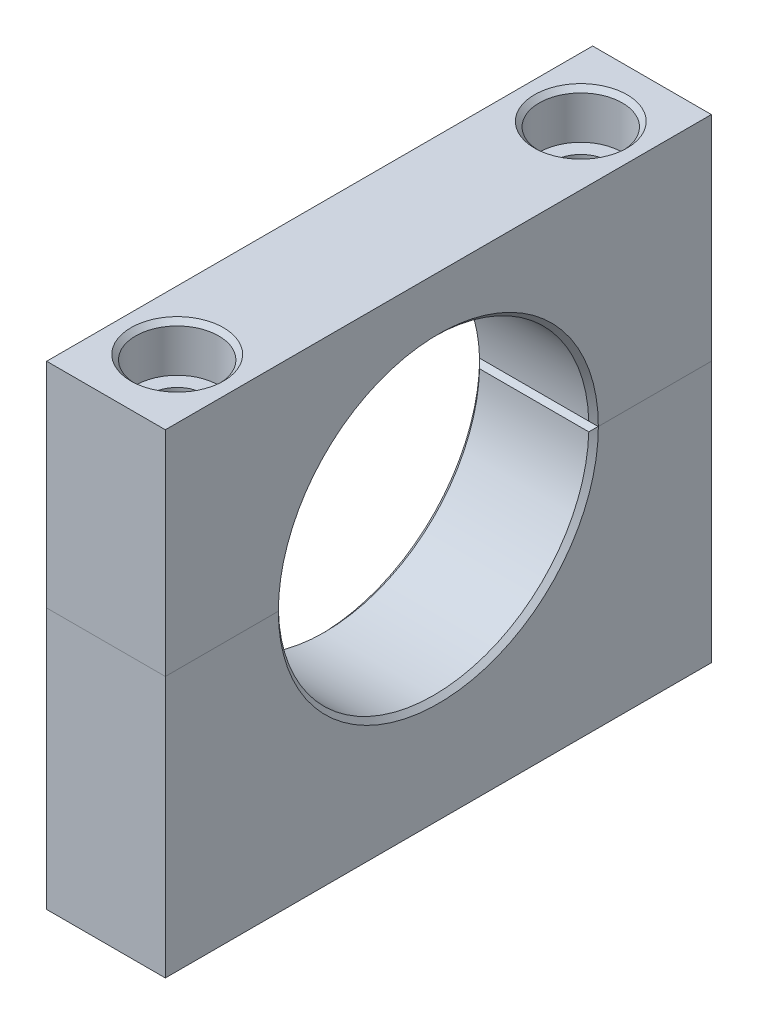
ISO-10303-21;
HEADER;
FILE_DESCRIPTION(('STEP AP214'),'2;1');
FILE_NAME('part.step','',(''),(''),'','','');
FILE_SCHEMA(('AUTOMOTIVE_DESIGN { 1 0 10303 214 1 1 1 1 }'));
ENDSEC;
DATA;
#1=APPLICATION_CONTEXT('core data for automotive mechanical design processes');
#2=APPLICATION_PROTOCOL_DEFINITION('international standard','automotive_design',2000,#1);
#3=PRODUCT_CONTEXT('',#1,'mechanical');
#4=PRODUCT('Part','Part','',(#3));
#5=PRODUCT_RELATED_PRODUCT_CATEGORY('part','',(#4));
#6=PRODUCT_DEFINITION_FORMATION('','',#4);
#7=PRODUCT_DEFINITION_CONTEXT('part definition',#1,'design');
#8=PRODUCT_DEFINITION('design','',#6,#7);
#9=PRODUCT_DEFINITION_SHAPE('','',#8);
#10=(LENGTH_UNIT() NAMED_UNIT(*) SI_UNIT(.MILLI.,.METRE.));
#11=(NAMED_UNIT(*) PLANE_ANGLE_UNIT() SI_UNIT($,.RADIAN.));
#12=(NAMED_UNIT(*) SI_UNIT($,.STERADIAN.) SOLID_ANGLE_UNIT());
#13=UNCERTAINTY_MEASURE_WITH_UNIT(LENGTH_MEASURE(1.E-05),#10,'distance_accuracy_value','');
#14=(GEOMETRIC_REPRESENTATION_CONTEXT(3) GLOBAL_UNCERTAINTY_ASSIGNED_CONTEXT((#13)) GLOBAL_UNIT_ASSIGNED_CONTEXT((#10,
#11,#12)) REPRESENTATION_CONTEXT('',''));
#15=CARTESIAN_POINT('',(0.,0.,0.));
#16=DIRECTION('',(0.,0.,1.));
#17=DIRECTION('',(1.,0.,0.));
#18=AXIS2_PLACEMENT_3D('',#15,#16,#17);
#19=CARTESIAN_POINT('',(15.875,0.,0.));
#20=DIRECTION('',(-1.,0.,0.));
#21=DIRECTION('',(0.,0.,1.));
#22=AXIS2_PLACEMENT_3D('',#19,#20,#21);
#23=CYLINDRICAL_SURFACE('',#22,20.7645);
#24=CARTESIAN_POINT('',(15.24,0.,0.));
#25=DIRECTION('',(1.,0.,0.));
#26=DIRECTION('',(0.,0.,-1.));
#27=AXIS2_PLACEMENT_3D('',#24,#25,#26);
#28=CIRCLE('',#27,20.7645);
#29=CARTESIAN_POINT('',(15.24,0.616157270029674,-20.7553561874662));
#30=VERTEX_POINT('',#29);
#31=CARTESIAN_POINT('',(15.24,0.616157270029674,20.7553561874662));
#32=VERTEX_POINT('',#31);
#33=EDGE_CURVE('E220',#30,#32,#28,.T.);
#34=ORIENTED_EDGE('',*,*,#33,.T.);
#35=DIRECTION('',(-1.,0.,0.));
#36=VECTOR('',#35,1.);
#37=CARTESIAN_POINT('',(15.875,0.616157270029674,20.7553561874662));
#38=LINE('',#37,#36);
#39=CARTESIAN_POINT('',(0.635,0.616157270029674,20.7553561874662));
#40=VERTEX_POINT('',#39);
#41=EDGE_CURVE('E222',#32,#40,#38,.T.);
#42=ORIENTED_EDGE('',*,*,#41,.T.);
#43=CARTESIAN_POINT('',(0.635,0.,0.));
#44=DIRECTION('',(1.,0.,0.));
#45=DIRECTION('',(0.,0.,-1.));
#46=AXIS2_PLACEMENT_3D('',#43,#44,#45);
#47=CIRCLE('',#46,20.7645);
#48=CARTESIAN_POINT('',(0.635,0.616157270029674,-20.7553561874662));
#49=VERTEX_POINT('',#48);
#50=EDGE_CURVE('E161',#40,#49,#47,.F.);
#51=ORIENTED_EDGE('',*,*,#50,.T.);
#52=DIRECTION('',(-1.,0.,0.));
#53=VECTOR('',#52,1.);
#54=CARTESIAN_POINT('',(15.875,0.616157270029674,-20.7553561874662));
#55=LINE('',#54,#53);
#56=EDGE_CURVE('E218',#49,#30,#55,.F.);
#57=ORIENTED_EDGE('',*,*,#56,.T.);
#58=EDGE_LOOP('',(#34,#42,#51,#57));
#59=FACE_BOUND('',#58,.T.);
#60=ADVANCED_FACE('F60',(#59),#23,.F.);
#61=CARTESIAN_POINT('',(15.875,0.,0.));
#62=DIRECTION('',(0.,1.,0.));
#63=DIRECTION('',(0.,0.,1.));
#64=AXIS2_PLACEMENT_3D('',#61,#62,#63);
#65=PLANE('',#64);
#66=CARTESIAN_POINT('',(7.9375,0.,-26.9875));
#67=DIRECTION('',(0.,1.,0.));
#68=DIRECTION('',(0.,0.,1.));
#69=AXIS2_PLACEMENT_3D('',#66,#67,#68);
#70=CIRCLE('',#69,3.57123999999999);
#71=CARTESIAN_POINT('',(7.9375,0.,-23.41626));
#72=VERTEX_POINT('',#71);
#73=EDGE_CURVE('E175',#72,#72,#70,.T.);
#74=ORIENTED_EDGE('',*,*,#73,.T.);
#75=EDGE_LOOP('',(#74));
#76=FACE_BOUND('',#75,.T.);
#77=DIRECTION('',(0.,0.,-1.));
#78=VECTOR('',#77,1.);
#79=CARTESIAN_POINT('',(15.875,0.,0.));
#80=LINE('',#79,#78);
#81=CARTESIAN_POINT('',(15.875,0.,-21.3995));
#82=VERTEX_POINT('',#81);
#83=CARTESIAN_POINT('',(15.875,0.,-36.5125));
#84=VERTEX_POINT('',#83);
#85=EDGE_CURVE('E140',#82,#84,#80,.T.);
#86=ORIENTED_EDGE('',*,*,#85,.F.);
#87=DIRECTION('',(-0.707106781186553,0.,0.707106781186542));
#88=VECTOR('',#87,1.);
#89=CARTESIAN_POINT('',(-5.52450000000034,0.,0.));
#90=LINE('',#89,#88);
#91=CARTESIAN_POINT('',(15.8655765601715,0.,-21.3900765601715));
#92=VERTEX_POINT('',#91);
#93=EDGE_CURVE('E75',#82,#92,#90,.T.);
#94=ORIENTED_EDGE('',*,*,#93,.T.);
#95=DIRECTION('',(-1.,0.,0.));
#96=VECTOR('',#95,1.);
#97=CARTESIAN_POINT('',(0.,0.,-21.3900765601715));
#98=LINE('',#97,#96);
#99=CARTESIAN_POINT('',(0.00942343982845999,0.,-21.3900765601715));
#100=VERTEX_POINT('',#99);
#101=EDGE_CURVE('E86',#92,#100,#98,.T.);
#102=ORIENTED_EDGE('',*,*,#101,.T.);
#103=DIRECTION('',(-0.707106781186553,0.,-0.707106781186542));
#104=VECTOR('',#103,1.);
#105=CARTESIAN_POINT('',(21.3995000000003,0.,0.));
#106=LINE('',#105,#104);
#107=CARTESIAN_POINT('',(0.,0.,-21.3995));
#108=VERTEX_POINT('',#107);
#109=EDGE_CURVE('E233',#100,#108,#106,.T.);
#110=ORIENTED_EDGE('',*,*,#109,.T.);
#111=DIRECTION('',(0.,0.,-1.));
#112=VECTOR('',#111,1.);
#113=CARTESIAN_POINT('',(0.,0.,0.));
#114=LINE('',#113,#112);
#115=CARTESIAN_POINT('',(0.,0.,-36.5125));
#116=VERTEX_POINT('',#115);
#117=EDGE_CURVE('E157',#108,#116,#114,.T.);
#118=ORIENTED_EDGE('',*,*,#117,.T.);
#119=DIRECTION('',(-1.,0.,0.));
#120=VECTOR('',#119,1.);
#121=CARTESIAN_POINT('',(15.875,0.,-36.5125));
#122=LINE('',#121,#120);
#123=EDGE_CURVE('E154',#84,#116,#122,.T.);
#124=ORIENTED_EDGE('',*,*,#123,.F.);
#125=EDGE_LOOP('',(#86,#94,#102,#110,#118,#124));
#126=FACE_BOUND('',#125,.T.);
#127=ADVANCED_FACE('F155',(#76,#126),#65,.F.);
#128=CARTESIAN_POINT('',(15.875,0.,-36.5125));
#129=DIRECTION('',(0.,0.,1.));
#130=DIRECTION('',(1.,0.,0.));
#131=AXIS2_PLACEMENT_3D('',#128,#129,#130);
#132=PLANE('',#131);
#133=DIRECTION('',(0.,1.,0.));
#134=VECTOR('',#133,1.);
#135=CARTESIAN_POINT('',(0.,0.,-36.5125));
#136=LINE('',#135,#134);
#137=CARTESIAN_POINT('',(0.,28.575,-36.5125));
#138=VERTEX_POINT('',#137);
#139=EDGE_CURVE('E174',#116,#138,#136,.T.);
#140=ORIENTED_EDGE('',*,*,#139,.T.);
#141=DIRECTION('',(-1.,0.,0.));
#142=VECTOR('',#141,1.);
#143=CARTESIAN_POINT('',(15.875,28.575,-36.5125));
#144=LINE('',#143,#142);
#145=CARTESIAN_POINT('',(15.875,28.575,-36.5125));
#146=VERTEX_POINT('',#145);
#147=EDGE_CURVE('E162',#146,#138,#144,.T.);
#148=ORIENTED_EDGE('',*,*,#147,.F.);
#149=DIRECTION('',(0.,1.,0.));
#150=VECTOR('',#149,1.);
#151=CARTESIAN_POINT('',(15.875,0.,-36.5125));
#152=LINE('',#151,#150);
#153=EDGE_CURVE('E146',#84,#146,#152,.T.);
#154=ORIENTED_EDGE('',*,*,#153,.F.);
#155=ORIENTED_EDGE('',*,*,#123,.T.);
#156=EDGE_LOOP('',(#140,#148,#154,#155));
#157=FACE_BOUND('',#156,.T.);
#158=ADVANCED_FACE('F164',(#157),#132,.F.);
#159=CARTESIAN_POINT('',(15.875,28.575,0.));
#160=DIRECTION('',(0.,1.,0.));
#161=DIRECTION('',(0.,0.,1.));
#162=AXIS2_PLACEMENT_3D('',#159,#160,#161);
#163=PLANE('',#162);
#164=CARTESIAN_POINT('',(7.93750000000001,28.575,26.9875));
#165=DIRECTION('',(0.,1.,0.));
#166=DIRECTION('',(0.,0.,1.));
#167=AXIS2_PLACEMENT_3D('',#164,#165,#166);
#168=CIRCLE('',#167,6.19125);
#169=CARTESIAN_POINT('',(7.93750000000001,28.575,33.17875));
#170=VERTEX_POINT('',#169);
#171=EDGE_CURVE('E195',#170,#170,#168,.T.);
#172=ORIENTED_EDGE('',*,*,#171,.F.);
#173=EDGE_LOOP('',(#172));
#174=FACE_BOUND('',#173,.T.);
#175=CARTESIAN_POINT('',(7.9375,28.575,-26.9875));
#176=DIRECTION('',(0.,1.,0.));
#177=DIRECTION('',(0.,0.,1.));
#178=AXIS2_PLACEMENT_3D('',#175,#176,#177);
#179=CIRCLE('',#178,6.19125);
#180=CARTESIAN_POINT('',(7.9375,28.575,-20.79625));
#181=VERTEX_POINT('',#180);
#182=EDGE_CURVE('E190',#181,#181,#179,.T.);
#183=ORIENTED_EDGE('',*,*,#182,.F.);
#184=EDGE_LOOP('',(#183));
#185=FACE_BOUND('',#184,.T.);
#186=DIRECTION('',(0.,0.,-1.));
#187=VECTOR('',#186,1.);
#188=CARTESIAN_POINT('',(0.,28.575,0.));
#189=LINE('',#188,#187);
#190=CARTESIAN_POINT('',(0.,28.575,36.5125));
#191=VERTEX_POINT('',#190);
#192=EDGE_CURVE('E177',#191,#138,#189,.T.);
#193=ORIENTED_EDGE('',*,*,#192,.F.);
#194=DIRECTION('',(-1.,0.,0.));
#195=VECTOR('',#194,1.);
#196=CARTESIAN_POINT('',(15.875,28.575,36.5125));
#197=LINE('',#196,#195);
#198=CARTESIAN_POINT('',(15.875,28.575,36.5125));
#199=VERTEX_POINT('',#198);
#200=EDGE_CURVE('E182',#199,#191,#197,.T.);
#201=ORIENTED_EDGE('',*,*,#200,.F.);
#202=DIRECTION('',(0.,0.,-1.));
#203=VECTOR('',#202,1.);
#204=CARTESIAN_POINT('',(15.875,28.575,0.));
#205=LINE('',#204,#203);
#206=EDGE_CURVE('E166',#199,#146,#205,.T.);
#207=ORIENTED_EDGE('',*,*,#206,.T.);
#208=ORIENTED_EDGE('',*,*,#147,.T.);
#209=EDGE_LOOP('',(#193,#201,#207,#208));
#210=FACE_BOUND('',#209,.T.);
#211=ADVANCED_FACE('F301',(#174,#185,#210),#163,.T.);
#212=CARTESIAN_POINT('',(15.875,0.,36.5125));
#213=DIRECTION('',(0.,0.,1.));
#214=DIRECTION('',(1.,0.,0.));
#215=AXIS2_PLACEMENT_3D('',#212,#213,#214);
#216=PLANE('',#215);
#217=DIRECTION('',(0.,1.,0.));
#218=VECTOR('',#217,1.);
#219=CARTESIAN_POINT('',(0.,0.,36.5125));
#220=LINE('',#219,#218);
#221=CARTESIAN_POINT('',(0.,0.,36.5125));
#222=VERTEX_POINT('',#221);
#223=EDGE_CURVE('E178',#222,#191,#220,.T.);
#224=ORIENTED_EDGE('',*,*,#223,.F.);
#225=DIRECTION('',(-1.,0.,0.));
#226=VECTOR('',#225,1.);
#227=CARTESIAN_POINT('',(15.875,0.,36.5125));
#228=LINE('',#227,#226);
#229=CARTESIAN_POINT('',(15.875,0.,36.5125));
#230=VERTEX_POINT('',#229);
#231=EDGE_CURVE('E181',#230,#222,#228,.T.);
#232=ORIENTED_EDGE('',*,*,#231,.F.);
#233=DIRECTION('',(0.,1.,0.));
#234=VECTOR('',#233,1.);
#235=CARTESIAN_POINT('',(15.875,0.,36.5125));
#236=LINE('',#235,#234);
#237=EDGE_CURVE('E168',#230,#199,#236,.T.);
#238=ORIENTED_EDGE('',*,*,#237,.T.);
#239=ORIENTED_EDGE('',*,*,#200,.T.);
#240=EDGE_LOOP('',(#224,#232,#238,#239));
#241=FACE_BOUND('',#240,.T.);
#242=ADVANCED_FACE('F304',(#241),#216,.T.);
#243=CARTESIAN_POINT('',(7.93750000000001,0.,26.9875));
#244=DIRECTION('',(0.,1.,0.));
#245=DIRECTION('',(0.,0.,1.));
#246=AXIS2_PLACEMENT_3D('',#243,#244,#245);
#247=CIRCLE('',#246,3.57123999999999);
#248=CARTESIAN_POINT('',(7.93750000000001,0.,30.55874));
#249=VERTEX_POINT('',#248);
#250=EDGE_CURVE('E187',#249,#249,#247,.T.);
#251=ORIENTED_EDGE('',*,*,#250,.T.);
#252=EDGE_LOOP('',(#251));
#253=FACE_BOUND('',#252,.T.);
#254=DIRECTION('',(1.,0.,0.));
#255=VECTOR('',#254,1.);
#256=CARTESIAN_POINT('',(15.875,0.,21.3900765601715));
#257=LINE('',#256,#255);
#258=CARTESIAN_POINT('',(0.00942343982845983,0.,21.3900765601715));
#259=VERTEX_POINT('',#258);
#260=CARTESIAN_POINT('',(15.8655765601715,0.,21.3900765601715));
#261=VERTEX_POINT('',#260);
#262=EDGE_CURVE('E227',#259,#261,#257,.T.);
#263=ORIENTED_EDGE('',*,*,#262,.T.);
#264=DIRECTION('',(0.707106781186553,0.,0.707106781186542));
#265=VECTOR('',#264,1.);
#266=CARTESIAN_POINT('',(-5.52450000000034,0.,0.));
#267=LINE('',#266,#265);
#268=CARTESIAN_POINT('',(15.875,0.,21.3995));
#269=VERTEX_POINT('',#268);
#270=EDGE_CURVE('E230',#261,#269,#267,.T.);
#271=ORIENTED_EDGE('',*,*,#270,.T.);
#272=EDGE_CURVE('E152',#230,#269,#80,.T.);
#273=ORIENTED_EDGE('',*,*,#272,.F.);
#274=ORIENTED_EDGE('',*,*,#231,.T.);
#275=CARTESIAN_POINT('',(0.,0.,21.3995));
#276=VERTEX_POINT('',#275);
#277=EDGE_CURVE('E150',#222,#276,#114,.T.);
#278=ORIENTED_EDGE('',*,*,#277,.T.);
#279=DIRECTION('',(0.707106781186553,0.,-0.707106781186542));
#280=VECTOR('',#279,1.);
#281=CARTESIAN_POINT('',(21.3995000000003,0.,0.));
#282=LINE('',#281,#280);
#283=EDGE_CURVE('E225',#276,#259,#282,.T.);
#284=ORIENTED_EDGE('',*,*,#283,.T.);
#285=EDGE_LOOP('',(#263,#271,#273,#274,#278,#284));
#286=FACE_BOUND('',#285,.T.);
#287=ADVANCED_FACE('F286',(#253,#286),#65,.F.);
#288=CARTESIAN_POINT('',(15.875,0.,0.));
#289=DIRECTION('',(1.,0.,0.));
#290=DIRECTION('',(0.,0.,-1.));
#291=AXIS2_PLACEMENT_3D('',#288,#289,#290);
#292=PLANE('',#291);
#293=ORIENTED_EDGE('',*,*,#272,.T.);
#294=CARTESIAN_POINT('',(15.875,0.,0.));
#295=DIRECTION('',(1.,0.,0.));
#296=DIRECTION('',(0.,0.,-1.));
#297=AXIS2_PLACEMENT_3D('',#294,#295,#296);
#298=CIRCLE('',#297,21.3995);
#299=EDGE_CURVE('E149',#269,#82,#298,.F.);
#300=ORIENTED_EDGE('',*,*,#299,.T.);
#301=ORIENTED_EDGE('',*,*,#85,.T.);
#302=ORIENTED_EDGE('',*,*,#153,.T.);
#303=ORIENTED_EDGE('',*,*,#206,.F.);
#304=ORIENTED_EDGE('',*,*,#237,.F.);
#305=EDGE_LOOP('',(#293,#300,#301,#302,#303,#304));
#306=FACE_BOUND('',#305,.T.);
#307=ADVANCED_FACE('F143',(#306),#292,.T.);
#308=CARTESIAN_POINT('',(0.,0.,0.));
#309=DIRECTION('',(1.,0.,0.));
#310=DIRECTION('',(0.,0.,-1.));
#311=AXIS2_PLACEMENT_3D('',#308,#309,#310);
#312=PLANE('',#311);
#313=ORIENTED_EDGE('',*,*,#117,.F.);
#314=CARTESIAN_POINT('',(0.,0.,0.));
#315=DIRECTION('',(1.,0.,0.));
#316=DIRECTION('',(0.,0.,-1.));
#317=AXIS2_PLACEMENT_3D('',#314,#315,#316);
#318=CIRCLE('',#317,21.3995);
#319=EDGE_CURVE('E13',#108,#276,#318,.T.);
#320=ORIENTED_EDGE('',*,*,#319,.T.);
#321=ORIENTED_EDGE('',*,*,#277,.F.);
#322=ORIENTED_EDGE('',*,*,#223,.T.);
#323=ORIENTED_EDGE('',*,*,#192,.T.);
#324=ORIENTED_EDGE('',*,*,#139,.F.);
#325=EDGE_LOOP('',(#313,#320,#321,#322,#323,#324));
#326=FACE_BOUND('',#325,.T.);
#327=ADVANCED_FACE('F334',(#326),#312,.F.);
#328=CARTESIAN_POINT('',(7.9375,34.925,-26.9875));
#329=DIRECTION('',(0.,1.,0.));
#330=DIRECTION('',(0.,0.,1.));
#331=AXIS2_PLACEMENT_3D('',#328,#329,#330);
#332=CYLINDRICAL_SURFACE('',#331,3.57123999999999);
#333=CARTESIAN_POINT('',(7.9375,22.225,-26.9875));
#334=DIRECTION('',(0.,1.,0.));
#335=DIRECTION('',(0.,0.,1.));
#336=AXIS2_PLACEMENT_3D('',#333,#334,#335);
#337=CIRCLE('',#336,3.57124);
#338=CARTESIAN_POINT('',(7.9375,22.225,-23.41626));
#339=VERTEX_POINT('',#338);
#340=EDGE_CURVE('E186',#339,#339,#337,.T.);
#341=ORIENTED_EDGE('',*,*,#340,.T.);
#342=EDGE_LOOP('',(#341));
#343=FACE_BOUND('',#342,.T.);
#344=ORIENTED_EDGE('',*,*,#73,.F.);
#345=EDGE_LOOP('',(#344));
#346=FACE_BOUND('',#345,.T.);
#347=ADVANCED_FACE('F299',(#343,#346),#332,.F.);
#348=CARTESIAN_POINT('',(13.49375,22.225,-26.9875));
#349=DIRECTION('',(0.,-1.,0.));
#350=DIRECTION('',(0.,0.,-1.));
#351=AXIS2_PLACEMENT_3D('',#348,#349,#350);
#352=PLANE('',#351);
#353=ORIENTED_EDGE('',*,*,#340,.F.);
#354=EDGE_LOOP('',(#353));
#355=FACE_BOUND('',#354,.T.);
#356=CARTESIAN_POINT('',(7.9375,22.225,-26.9875));
#357=DIRECTION('',(0.,1.,0.));
#358=DIRECTION('',(0.,0.,1.));
#359=AXIS2_PLACEMENT_3D('',#356,#357,#358);
#360=CIRCLE('',#359,5.55625);
#361=CARTESIAN_POINT('',(7.9375,22.225,-21.43125));
#362=VERTEX_POINT('',#361);
#363=EDGE_CURVE('E201',#362,#362,#360,.T.);
#364=ORIENTED_EDGE('',*,*,#363,.T.);
#365=EDGE_LOOP('',(#364));
#366=FACE_BOUND('',#365,.T.);
#367=ADVANCED_FACE('F296',(#355,#366),#352,.F.);
#368=CARTESIAN_POINT('',(7.9375,34.925,-26.9875));
#369=DIRECTION('',(0.,1.,0.));
#370=DIRECTION('',(0.,0.,1.));
#371=AXIS2_PLACEMENT_3D('',#368,#369,#370);
#372=CYLINDRICAL_SURFACE('',#371,5.55625);
#373=ORIENTED_EDGE('',*,*,#363,.F.);
#374=EDGE_LOOP('',(#373));
#375=FACE_BOUND('',#374,.T.);
#376=CARTESIAN_POINT('',(7.9375,27.94,-26.9875));
#377=DIRECTION('',(0.,1.,0.));
#378=DIRECTION('',(0.,0.,1.));
#379=AXIS2_PLACEMENT_3D('',#376,#377,#378);
#380=CIRCLE('',#379,5.55625);
#381=CARTESIAN_POINT('',(7.9375,27.94,-21.43125));
#382=VERTEX_POINT('',#381);
#383=EDGE_CURVE('E194',#382,#382,#380,.T.);
#384=ORIENTED_EDGE('',*,*,#383,.T.);
#385=EDGE_LOOP('',(#384));
#386=FACE_BOUND('',#385,.T.);
#387=ADVANCED_FACE('F294',(#375,#386),#372,.F.);
#388=CARTESIAN_POINT('',(7.9375,28.575,-26.9875));
#389=DIRECTION('',(0.,1.,0.));
#390=DIRECTION('',(0.,0.,1.));
#391=AXIS2_PLACEMENT_3D('',#388,#389,#390);
#392=CONICAL_SURFACE('',#391,6.19125,0.785398163397446);
#393=ORIENTED_EDGE('',*,*,#383,.F.);
#394=EDGE_LOOP('',(#393));
#395=FACE_BOUND('',#394,.T.);
#396=ORIENTED_EDGE('',*,*,#182,.T.);
#397=EDGE_LOOP('',(#396));
#398=FACE_BOUND('',#397,.T.);
#399=ADVANCED_FACE('F290',(#395,#398),#392,.F.);
#400=CARTESIAN_POINT('',(7.93750000000001,34.925,26.9875));
#401=DIRECTION('',(0.,1.,0.));
#402=DIRECTION('',(0.,0.,1.));
#403=AXIS2_PLACEMENT_3D('',#400,#401,#402);
#404=CYLINDRICAL_SURFACE('',#403,3.57123999999999);
#405=CARTESIAN_POINT('',(7.93750000000001,22.225,26.9875));
#406=DIRECTION('',(0.,1.,0.));
#407=DIRECTION('',(0.,0.,1.));
#408=AXIS2_PLACEMENT_3D('',#405,#406,#407);
#409=CIRCLE('',#408,3.57124);
#410=CARTESIAN_POINT('',(7.93750000000001,22.225,30.55874));
#411=VERTEX_POINT('',#410);
#412=EDGE_CURVE('E191',#411,#411,#409,.T.);
#413=ORIENTED_EDGE('',*,*,#412,.T.);
#414=EDGE_LOOP('',(#413));
#415=FACE_BOUND('',#414,.T.);
#416=ORIENTED_EDGE('',*,*,#250,.F.);
#417=EDGE_LOOP('',(#416));
#418=FACE_BOUND('',#417,.T.);
#419=ADVANCED_FACE('F293',(#415,#418),#404,.F.);
#420=CARTESIAN_POINT('',(13.49375,22.225,26.9875));
#421=DIRECTION('',(0.,-1.,0.));
#422=DIRECTION('',(0.,0.,-1.));
#423=AXIS2_PLACEMENT_3D('',#420,#421,#422);
#424=PLANE('',#423);
#425=ORIENTED_EDGE('',*,*,#412,.F.);
#426=EDGE_LOOP('',(#425));
#427=FACE_BOUND('',#426,.T.);
#428=CARTESIAN_POINT('',(7.93750000000001,22.225,26.9875));
#429=DIRECTION('',(0.,1.,0.));
#430=DIRECTION('',(0.,0.,1.));
#431=AXIS2_PLACEMENT_3D('',#428,#429,#430);
#432=CIRCLE('',#431,5.55625);
#433=CARTESIAN_POINT('',(7.93750000000001,22.225,32.54375));
#434=VERTEX_POINT('',#433);
#435=EDGE_CURVE('E208',#434,#434,#432,.T.);
#436=ORIENTED_EDGE('',*,*,#435,.T.);
#437=EDGE_LOOP('',(#436));
#438=FACE_BOUND('',#437,.T.);
#439=ADVANCED_FACE('F309',(#427,#438),#424,.F.);
#440=CARTESIAN_POINT('',(7.93750000000001,34.925,26.9875));
#441=DIRECTION('',(0.,1.,0.));
#442=DIRECTION('',(0.,0.,1.));
#443=AXIS2_PLACEMENT_3D('',#440,#441,#442);
#444=CYLINDRICAL_SURFACE('',#443,5.55625);
#445=ORIENTED_EDGE('',*,*,#435,.F.);
#446=EDGE_LOOP('',(#445));
#447=FACE_BOUND('',#446,.T.);
#448=CARTESIAN_POINT('',(7.93750000000001,27.94,26.9875));
#449=DIRECTION('',(0.,1.,0.));
#450=DIRECTION('',(0.,0.,1.));
#451=AXIS2_PLACEMENT_3D('',#448,#449,#450);
#452=CIRCLE('',#451,5.55625);
#453=CARTESIAN_POINT('',(7.93750000000001,27.94,32.54375));
#454=VERTEX_POINT('',#453);
#455=EDGE_CURVE('E198',#454,#454,#452,.T.);
#456=ORIENTED_EDGE('',*,*,#455,.T.);
#457=EDGE_LOOP('',(#456));
#458=FACE_BOUND('',#457,.T.);
#459=ADVANCED_FACE('F307',(#447,#458),#444,.F.);
#460=CARTESIAN_POINT('',(7.93750000000001,28.575,26.9875));
#461=DIRECTION('',(0.,1.,0.));
#462=DIRECTION('',(0.,0.,1.));
#463=AXIS2_PLACEMENT_3D('',#460,#461,#462);
#464=CONICAL_SURFACE('',#463,6.19125,0.785398163397446);
#465=ORIENTED_EDGE('',*,*,#455,.F.);
#466=EDGE_LOOP('',(#465));
#467=FACE_BOUND('',#466,.T.);
#468=ORIENTED_EDGE('',*,*,#171,.T.);
#469=EDGE_LOOP('',(#468));
#470=FACE_BOUND('',#469,.T.);
#471=ADVANCED_FACE('F275',(#467,#470),#464,.F.);
#472=CARTESIAN_POINT('',(15.875,0.,-21.3900765601715));
#473=DIRECTION('',(0.,0.717521285574314,-0.696536578183647));
#474=DIRECTION('',(-1.,0.,0.));
#475=AXIS2_PLACEMENT_3D('',#472,#473,#474);
#476=PLANE('',#475);
#477=CARTESIAN_POINT('',(0.00942343982845999,0.,-21.3900765601715));
#478=CARTESIAN_POINT('',(0.11471717403378,0.102185013158632,-21.2848129971305));
#479=CARTESIAN_POINT('',(0.219495411785423,0.204623949544591,-21.1792878608624));
#480=CARTESIAN_POINT('',(0.428020932216734,0.41000970603686,-20.9677144034838));
#481=CARTESIAN_POINT('',(0.531768214522271,0.512956526327458,-20.8616660821834));
#482=CARTESIAN_POINT('',(0.634999999999999,0.616157270029674,-20.7553561874662));
#483=B_SPLINE_CURVE_WITH_KNOTS('',3,(#477,#478,#479,#480,#481,#482),.UNSPECIFIED.,.F.,.F.,(4,2,
4),(0.,0.54172864296396,1.0834574825131),.UNSPECIFIED.);
#484=EDGE_CURVE('E346',#100,#49,#483,.T.);
#485=ORIENTED_EDGE('',*,*,#484,.F.);
#486=ORIENTED_EDGE('',*,*,#101,.F.);
#487=CARTESIAN_POINT('',(15.8655765601715,0.,-21.3900765601715));
#488=CARTESIAN_POINT('',(15.7602828259662,0.102185013158632,-21.2848129971305));
#489=CARTESIAN_POINT('',(15.6555045882146,0.204623949544591,-21.1792878608624));
#490=CARTESIAN_POINT('',(15.4469790677833,0.410009706036859,-20.9677144034838));
#491=CARTESIAN_POINT('',(15.3432317854777,0.512956526327458,-20.8616660821834));
#492=CARTESIAN_POINT('',(15.24,0.616157270029675,-20.7553561874662));
#493=B_SPLINE_CURVE_WITH_KNOTS('',3,(#487,#488,#489,#490,#491,#492),.UNSPECIFIED.,.F.,.F.,(4,2,
4),(0.,0.541728642963961,1.0834574825131),.UNSPECIFIED.);
#494=EDGE_CURVE('E66',#30,#92,#493,.F.);
#495=ORIENTED_EDGE('',*,*,#494,.F.);
#496=ORIENTED_EDGE('',*,*,#56,.F.);
#497=EDGE_LOOP('',(#485,#486,#495,#496));
#498=FACE_BOUND('',#497,.T.);
#499=ADVANCED_FACE('F63',(#498),#476,.F.);
#500=CARTESIAN_POINT('',(15.24,0.,0.));
#501=DIRECTION('',(1.,0.,0.));
#502=DIRECTION('',(0.,0.,-1.));
#503=AXIS2_PLACEMENT_3D('',#500,#501,#502);
#504=CONICAL_SURFACE('',#503,20.7645,0.78539816339744);
#505=ORIENTED_EDGE('',*,*,#299,.F.);
#506=ORIENTED_EDGE('',*,*,#270,.F.);
#507=CARTESIAN_POINT('',(15.8655765601715,0.,21.3900765601715));
#508=CARTESIAN_POINT('',(15.7602828259662,0.102185013158632,21.2848129971305));
#509=CARTESIAN_POINT('',(15.6555045882146,0.204623949544591,21.1792878608624));
#510=CARTESIAN_POINT('',(15.4469790677833,0.410009706036859,20.9677144034838));
#511=CARTESIAN_POINT('',(15.3432317854777,0.512956526327458,20.8616660821834));
#512=CARTESIAN_POINT('',(15.24,0.616157270029675,20.7553561874662));
#513=B_SPLINE_CURVE_WITH_KNOTS('',3,(#507,#508,#509,#510,#511,#512),.UNSPECIFIED.,.F.,.F.,(4,2,
4),(0.,0.541728642963961,1.0834574825131),.UNSPECIFIED.);
#514=EDGE_CURVE('E245',#32,#261,#513,.F.);
#515=ORIENTED_EDGE('',*,*,#514,.F.);
#516=ORIENTED_EDGE('',*,*,#33,.F.);
#517=ORIENTED_EDGE('',*,*,#494,.T.);
#518=ORIENTED_EDGE('',*,*,#93,.F.);
#519=EDGE_LOOP('',(#505,#506,#515,#516,#517,#518));
#520=FACE_BOUND('',#519,.T.);
#521=ADVANCED_FACE('F262',(#520),#504,.F.);
#522=CARTESIAN_POINT('',(0.,0.,0.));
#523=DIRECTION('',(-1.,0.,0.));
#524=DIRECTION('',(0.,0.,1.));
#525=AXIS2_PLACEMENT_3D('',#522,#523,#524);
#526=CONICAL_SURFACE('',#525,21.3995,0.78539816339744);
#527=ORIENTED_EDGE('',*,*,#484,.T.);
#528=ORIENTED_EDGE('',*,*,#50,.F.);
#529=CARTESIAN_POINT('',(0.635,0.616157270029674,20.7553561874662));
#530=CARTESIAN_POINT('',(0.531768214522272,0.512956526327458,20.8616660821834));
#531=CARTESIAN_POINT('',(0.428020932216735,0.41000970603686,20.9677144034838));
#532=CARTESIAN_POINT('',(0.219495411785423,0.204623949544592,21.1792878608624));
#533=CARTESIAN_POINT('',(0.11471717403378,0.102185013158632,21.2848129971305));
#534=CARTESIAN_POINT('',(0.00942343982846062,0.,21.3900765601715));
#535=B_SPLINE_CURVE_WITH_KNOTS('',3,(#529,#530,#531,#532,#533,#534),.UNSPECIFIED.,.F.,.F.,(4,2,
4),(0.,0.541728839549139,1.0834574825131),.UNSPECIFIED.);
#536=EDGE_CURVE('E237',#259,#40,#535,.F.);
#537=ORIENTED_EDGE('',*,*,#536,.F.);
#538=ORIENTED_EDGE('',*,*,#283,.F.);
#539=ORIENTED_EDGE('',*,*,#319,.F.);
#540=ORIENTED_EDGE('',*,*,#109,.F.);
#541=EDGE_LOOP('',(#527,#528,#537,#538,#539,#540));
#542=FACE_BOUND('',#541,.T.);
#543=ADVANCED_FACE('F251',(#542),#526,.F.);
#544=CARTESIAN_POINT('',(15.875,0.616157270029674,20.7553561874662));
#545=DIRECTION('',(0.,0.717521285574314,0.696536578183647));
#546=DIRECTION('',(-1.,0.,0.));
#547=AXIS2_PLACEMENT_3D('',#544,#545,#546);
#548=PLANE('',#547);
#549=ORIENTED_EDGE('',*,*,#514,.T.);
#550=ORIENTED_EDGE('',*,*,#262,.F.);
#551=ORIENTED_EDGE('',*,*,#536,.T.);
#552=ORIENTED_EDGE('',*,*,#41,.F.);
#553=EDGE_LOOP('',(#549,#550,#551,#552));
#554=FACE_BOUND('',#553,.T.);
#555=ADVANCED_FACE('F255',(#554),#548,.F.);
#556=CLOSED_SHELL('',(#60,#127,#158,#211,#242,#287,#307,#327,#347,#367,#387,#399,#419,#439,#459,
#471,#499,#521,#543,#555));
#557=MANIFOLD_SOLID_BREP('B2',#556);
#558=CARTESIAN_POINT('',(15.875,0.,0.));
#559=DIRECTION('',(-1.,0.,0.));
#560=DIRECTION('',(0.,0.,1.));
#561=AXIS2_PLACEMENT_3D('',#558,#559,#560);
#562=CYLINDRICAL_SURFACE('',#561,20.7645);
#563=CARTESIAN_POINT('',(15.24,0.,0.));
#564=DIRECTION('',(1.,0.,0.));
#565=DIRECTION('',(0.,0.,-1.));
#566=AXIS2_PLACEMENT_3D('',#563,#564,#565);
#567=CIRCLE('',#566,20.7645);
#568=CARTESIAN_POINT('',(15.24,-0.616157270029674,20.7553561874662));
#569=VERTEX_POINT('',#568);
#570=CARTESIAN_POINT('',(15.24,-0.616157270029674,-20.7553561874662));
#571=VERTEX_POINT('',#570);
#572=EDGE_CURVE('E637',#569,#571,#567,.T.);
#573=ORIENTED_EDGE('',*,*,#572,.T.);
#574=DIRECTION('',(-1.,0.,0.));
#575=VECTOR('',#574,1.);
#576=CARTESIAN_POINT('',(15.875,-0.616157270029674,-20.7553561874662));
#577=LINE('',#576,#575);
#578=CARTESIAN_POINT('',(0.635,-0.616157270029674,-20.7553561874662));
#579=VERTEX_POINT('',#578);
#580=EDGE_CURVE('E639',#571,#579,#577,.T.);
#581=ORIENTED_EDGE('',*,*,#580,.T.);
#582=CARTESIAN_POINT('',(0.635,0.,0.));
#583=DIRECTION('',(1.,0.,0.));
#584=DIRECTION('',(0.,0.,-1.));
#585=AXIS2_PLACEMENT_3D('',#582,#583,#584);
#586=CIRCLE('',#585,20.7645);
#587=CARTESIAN_POINT('',(0.635,-0.616157270029674,20.7553561874662));
#588=VERTEX_POINT('',#587);
#589=EDGE_CURVE('E595',#579,#588,#586,.F.);
#590=ORIENTED_EDGE('',*,*,#589,.T.);
#591=DIRECTION('',(-1.,0.,0.));
#592=VECTOR('',#591,1.);
#593=CARTESIAN_POINT('',(15.875,-0.616157270029674,20.7553561874662));
#594=LINE('',#593,#592);
#595=EDGE_CURVE('E635',#588,#569,#594,.F.);
#596=ORIENTED_EDGE('',*,*,#595,.T.);
#597=EDGE_LOOP('',(#573,#581,#590,#596));
#598=FACE_BOUND('',#597,.T.);
#599=ADVANCED_FACE('F505',(#598),#562,.F.);
#600=CARTESIAN_POINT('',(15.875,0.,0.));
#601=DIRECTION('',(0.,1.,0.));
#602=DIRECTION('',(0.,0.,1.));
#603=AXIS2_PLACEMENT_3D('',#600,#601,#602);
#604=PLANE('',#603);
#605=CARTESIAN_POINT('',(7.93750000000001,0.,26.9875));
#606=DIRECTION('',(0.,1.,0.));
#607=DIRECTION('',(0.,0.,1.));
#608=AXIS2_PLACEMENT_3D('',#605,#606,#607);
#609=CIRCLE('',#608,3.57123999999999);
#610=CARTESIAN_POINT('',(7.93750000000001,0.,30.55874));
#611=VERTEX_POINT('',#610);
#612=EDGE_CURVE('E732',#611,#611,#609,.T.);
#613=ORIENTED_EDGE('',*,*,#612,.F.);
#614=EDGE_LOOP('',(#613));
#615=FACE_BOUND('',#614,.T.);
#616=DIRECTION('',(0.,0.,-1.));
#617=VECTOR('',#616,1.);
#618=CARTESIAN_POINT('',(15.875,0.,0.));
#619=LINE('',#618,#617);
#620=CARTESIAN_POINT('',(15.875,0.,36.5125));
#621=VERTEX_POINT('',#620);
#622=CARTESIAN_POINT('',(15.875,0.,21.3995));
#623=VERTEX_POINT('',#622);
#624=EDGE_CURVE('E588',#621,#623,#619,.T.);
#625=ORIENTED_EDGE('',*,*,#624,.T.);
#626=DIRECTION('',(0.707106781186549,0.,0.707106781186546));
#627=VECTOR('',#626,1.);
#628=CARTESIAN_POINT('',(-5.52450000000011,0.,0.));
#629=LINE('',#628,#627);
#630=CARTESIAN_POINT('',(15.8655765601715,0.,21.3900765601715));
#631=VERTEX_POINT('',#630);
#632=EDGE_CURVE('E520',#623,#631,#629,.F.);
#633=ORIENTED_EDGE('',*,*,#632,.T.);
#634=DIRECTION('',(-1.,0.,0.));
#635=VECTOR('',#634,1.);
#636=CARTESIAN_POINT('',(15.875,0.,21.3900765601715));
#637=LINE('',#636,#635);
#638=CARTESIAN_POINT('',(0.00942343982845983,0.,21.3900765601715));
#639=VERTEX_POINT('',#638);
#640=EDGE_CURVE('E531',#631,#639,#637,.T.);
#641=ORIENTED_EDGE('',*,*,#640,.T.);
#642=DIRECTION('',(0.707106781186549,0.,-0.707106781186546));
#643=VECTOR('',#642,1.);
#644=CARTESIAN_POINT('',(21.3995000000001,0.,0.));
#645=LINE('',#644,#643);
#646=CARTESIAN_POINT('',(0.,0.,21.3995));
#647=VERTEX_POINT('',#646);
#648=EDGE_CURVE('E650',#639,#647,#645,.F.);
#649=ORIENTED_EDGE('',*,*,#648,.T.);
#650=DIRECTION('',(0.,0.,-1.));
#651=VECTOR('',#650,1.);
#652=CARTESIAN_POINT('',(0.,0.,0.));
#653=LINE('',#652,#651);
#654=CARTESIAN_POINT('',(0.,0.,36.5125));
#655=VERTEX_POINT('',#654);
#656=EDGE_CURVE('E590',#655,#647,#653,.T.);
#657=ORIENTED_EDGE('',*,*,#656,.F.);
#658=DIRECTION('',(-1.,0.,0.));
#659=VECTOR('',#658,1.);
#660=CARTESIAN_POINT('',(15.875,0.,36.5125));
#661=LINE('',#660,#659);
#662=EDGE_CURVE('E585',#621,#655,#661,.T.);
#663=ORIENTED_EDGE('',*,*,#662,.F.);
#664=EDGE_LOOP('',(#625,#633,#641,#649,#657,#663));
#665=FACE_BOUND('',#664,.T.);
#666=ADVANCED_FACE('F587',(#615,#665),#604,.T.);
#667=CARTESIAN_POINT('',(15.875,0.,36.5125));
#668=DIRECTION('',(0.,0.,1.));
#669=DIRECTION('',(1.,0.,0.));
#670=AXIS2_PLACEMENT_3D('',#667,#668,#669);
#671=PLANE('',#670);
#672=DIRECTION('',(0.,1.,0.));
#673=VECTOR('',#672,1.);
#674=CARTESIAN_POINT('',(0.,0.,36.5125));
#675=LINE('',#674,#673);
#676=CARTESIAN_POINT('',(0.,-34.925,36.5125));
#677=VERTEX_POINT('',#676);
#678=EDGE_CURVE('E619',#677,#655,#675,.T.);
#679=ORIENTED_EDGE('',*,*,#678,.F.);
#680=DIRECTION('',(-1.,0.,0.));
#681=VECTOR('',#680,1.);
#682=CARTESIAN_POINT('',(15.875,-34.925,36.5125));
#683=LINE('',#682,#681);
#684=CARTESIAN_POINT('',(15.875,-34.925,36.5125));
#685=VERTEX_POINT('',#684);
#686=EDGE_CURVE('E596',#685,#677,#683,.T.);
#687=ORIENTED_EDGE('',*,*,#686,.F.);
#688=DIRECTION('',(0.,1.,0.));
#689=VECTOR('',#688,1.);
#690=CARTESIAN_POINT('',(15.875,0.,36.5125));
#691=LINE('',#690,#689);
#692=EDGE_CURVE('E602',#685,#621,#691,.T.);
#693=ORIENTED_EDGE('',*,*,#692,.T.);
#694=ORIENTED_EDGE('',*,*,#662,.T.);
#695=EDGE_LOOP('',(#679,#687,#693,#694));
#696=FACE_BOUND('',#695,.T.);
#697=ADVANCED_FACE('F608',(#696),#671,.T.);
#698=CARTESIAN_POINT('',(15.875,-34.925,0.));
#699=DIRECTION('',(0.,1.,0.));
#700=DIRECTION('',(0.,0.,1.));
#701=AXIS2_PLACEMENT_3D('',#698,#699,#700);
#702=PLANE('',#701);
#703=CARTESIAN_POINT('',(7.93750000000001,-34.925,26.9875));
#704=DIRECTION('',(0.,1.,0.));
#705=DIRECTION('',(0.,0.,1.));
#706=AXIS2_PLACEMENT_3D('',#703,#704,#705);
#707=CIRCLE('',#706,3.57123999999998);
#708=CARTESIAN_POINT('',(7.93750000000001,-34.925,30.55874));
#709=VERTEX_POINT('',#708);
#710=EDGE_CURVE('E735',#709,#709,#707,.T.);
#711=ORIENTED_EDGE('',*,*,#710,.T.);
#712=EDGE_LOOP('',(#711));
#713=FACE_BOUND('',#712,.T.);
#714=CARTESIAN_POINT('',(7.9375,-34.925,-26.9875));
#715=DIRECTION('',(0.,1.,0.));
#716=DIRECTION('',(0.,0.,1.));
#717=AXIS2_PLACEMENT_3D('',#714,#715,#716);
#718=CIRCLE('',#717,3.57123999999998);
#719=CARTESIAN_POINT('',(7.9375,-34.925,-23.41626));
#720=VERTEX_POINT('',#719);
#721=EDGE_CURVE('E737',#720,#720,#718,.T.);
#722=ORIENTED_EDGE('',*,*,#721,.T.);
#723=EDGE_LOOP('',(#722));
#724=FACE_BOUND('',#723,.T.);
#725=DIRECTION('',(0.,0.,-1.));
#726=VECTOR('',#725,1.);
#727=CARTESIAN_POINT('',(0.,-34.925,0.));
#728=LINE('',#727,#726);
#729=CARTESIAN_POINT('',(0.,-34.925,-36.5125));
#730=VERTEX_POINT('',#729);
#731=EDGE_CURVE('E622',#677,#730,#728,.T.);
#732=ORIENTED_EDGE('',*,*,#731,.T.);
#733=DIRECTION('',(-1.,0.,0.));
#734=VECTOR('',#733,1.);
#735=CARTESIAN_POINT('',(15.875,-34.925,-36.5125));
#736=LINE('',#735,#734);
#737=CARTESIAN_POINT('',(15.875,-34.925,-36.5125));
#738=VERTEX_POINT('',#737);
#739=EDGE_CURVE('E630',#738,#730,#736,.T.);
#740=ORIENTED_EDGE('',*,*,#739,.F.);
#741=DIRECTION('',(0.,0.,-1.));
#742=VECTOR('',#741,1.);
#743=CARTESIAN_POINT('',(15.875,-34.925,0.));
#744=LINE('',#743,#742);
#745=EDGE_CURVE('E610',#685,#738,#744,.T.);
#746=ORIENTED_EDGE('',*,*,#745,.F.);
#747=ORIENTED_EDGE('',*,*,#686,.T.);
#748=EDGE_LOOP('',(#732,#740,#746,#747));
#749=FACE_BOUND('',#748,.T.);
#750=ADVANCED_FACE('F706',(#713,#724,#749),#702,.F.);
#751=CARTESIAN_POINT('',(15.875,0.,-36.5125));
#752=DIRECTION('',(0.,0.,1.));
#753=DIRECTION('',(1.,0.,0.));
#754=AXIS2_PLACEMENT_3D('',#751,#752,#753);
#755=PLANE('',#754);
#756=DIRECTION('',(0.,1.,0.));
#757=VECTOR('',#756,1.);
#758=CARTESIAN_POINT('',(0.,0.,-36.5125));
#759=LINE('',#758,#757);
#760=CARTESIAN_POINT('',(0.,0.,-36.5125));
#761=VERTEX_POINT('',#760);
#762=EDGE_CURVE('E624',#730,#761,#759,.T.);
#763=ORIENTED_EDGE('',*,*,#762,.T.);
#764=DIRECTION('',(-1.,0.,0.));
#765=VECTOR('',#764,1.);
#766=CARTESIAN_POINT('',(15.875,0.,-36.5125));
#767=LINE('',#766,#765);
#768=CARTESIAN_POINT('',(15.875,0.,-36.5125));
#769=VERTEX_POINT('',#768);
#770=EDGE_CURVE('E627',#769,#761,#767,.T.);
#771=ORIENTED_EDGE('',*,*,#770,.F.);
#772=DIRECTION('',(0.,1.,0.));
#773=VECTOR('',#772,1.);
#774=CARTESIAN_POINT('',(15.875,0.,-36.5125));
#775=LINE('',#774,#773);
#776=EDGE_CURVE('E612',#738,#769,#775,.T.);
#777=ORIENTED_EDGE('',*,*,#776,.F.);
#778=ORIENTED_EDGE('',*,*,#739,.T.);
#779=EDGE_LOOP('',(#763,#771,#777,#778));
#780=FACE_BOUND('',#779,.T.);
#781=ADVANCED_FACE('F709',(#780),#755,.F.);
#782=CARTESIAN_POINT('',(7.9375,0.,-26.9875));
#783=DIRECTION('',(0.,1.,0.));
#784=DIRECTION('',(0.,0.,1.));
#785=AXIS2_PLACEMENT_3D('',#782,#783,#784);
#786=CIRCLE('',#785,3.57123999999999);
#787=CARTESIAN_POINT('',(7.9375,0.,-23.41626));
#788=VERTEX_POINT('',#787);
#789=EDGE_CURVE('E620',#788,#788,#786,.T.);
#790=ORIENTED_EDGE('',*,*,#789,.F.);
#791=EDGE_LOOP('',(#790));
#792=FACE_BOUND('',#791,.T.);
#793=DIRECTION('',(1.,0.,0.));
#794=VECTOR('',#793,1.);
#795=CARTESIAN_POINT('',(15.875,0.,-21.3900765601715));
#796=LINE('',#795,#794);
#797=CARTESIAN_POINT('',(0.00942343982845983,0.,-21.3900765601715));
#798=VERTEX_POINT('',#797);
#799=CARTESIAN_POINT('',(15.8655765601715,0.,-21.3900765601715));
#800=VERTEX_POINT('',#799);
#801=EDGE_CURVE('E644',#798,#800,#796,.T.);
#802=ORIENTED_EDGE('',*,*,#801,.T.);
#803=DIRECTION('',(-0.707106781186549,0.,0.707106781186546));
#804=VECTOR('',#803,1.);
#805=CARTESIAN_POINT('',(-5.52450000000011,0.,0.));
#806=LINE('',#805,#804);
#807=CARTESIAN_POINT('',(15.875,0.,-21.3995));
#808=VERTEX_POINT('',#807);
#809=EDGE_CURVE('E647',#800,#808,#806,.F.);
#810=ORIENTED_EDGE('',*,*,#809,.T.);
#811=EDGE_CURVE('E607',#808,#769,#619,.T.);
#812=ORIENTED_EDGE('',*,*,#811,.T.);
#813=ORIENTED_EDGE('',*,*,#770,.T.);
#814=CARTESIAN_POINT('',(0.,0.,-21.3995));
#815=VERTEX_POINT('',#814);
#816=EDGE_CURVE('E605',#815,#761,#653,.T.);
#817=ORIENTED_EDGE('',*,*,#816,.F.);
#818=DIRECTION('',(-0.707106781186549,0.,-0.707106781186546));
#819=VECTOR('',#818,1.);
#820=CARTESIAN_POINT('',(21.3995000000001,0.,0.));
#821=LINE('',#820,#819);
#822=EDGE_CURVE('E642',#815,#798,#821,.F.);
#823=ORIENTED_EDGE('',*,*,#822,.T.);
#824=EDGE_LOOP('',(#802,#810,#812,#813,#817,#823));
#825=FACE_BOUND('',#824,.T.);
#826=ADVANCED_FACE('F702',(#792,#825),#604,.T.);
#827=CARTESIAN_POINT('',(15.875,0.,0.));
#828=DIRECTION('',(1.,0.,0.));
#829=DIRECTION('',(0.,0.,-1.));
#830=AXIS2_PLACEMENT_3D('',#827,#828,#829);
#831=PLANE('',#830);
#832=ORIENTED_EDGE('',*,*,#811,.F.);
#833=CARTESIAN_POINT('',(15.875,0.,0.));
#834=DIRECTION('',(1.,0.,0.));
#835=DIRECTION('',(0.,0.,-1.));
#836=AXIS2_PLACEMENT_3D('',#833,#834,#835);
#837=CIRCLE('',#836,21.3995);
#838=EDGE_CURVE('E604',#808,#623,#837,.F.);
#839=ORIENTED_EDGE('',*,*,#838,.T.);
#840=ORIENTED_EDGE('',*,*,#624,.F.);
#841=ORIENTED_EDGE('',*,*,#692,.F.);
#842=ORIENTED_EDGE('',*,*,#745,.T.);
#843=ORIENTED_EDGE('',*,*,#776,.T.);
#844=EDGE_LOOP('',(#832,#839,#840,#841,#842,#843));
#845=FACE_BOUND('',#844,.T.);
#846=ADVANCED_FACE('F601',(#845),#831,.T.);
#847=CARTESIAN_POINT('',(0.,0.,0.));
#848=DIRECTION('',(1.,0.,0.));
#849=DIRECTION('',(0.,0.,-1.));
#850=AXIS2_PLACEMENT_3D('',#847,#848,#849);
#851=PLANE('',#850);
#852=ORIENTED_EDGE('',*,*,#656,.T.);
#853=CARTESIAN_POINT('',(0.,0.,0.));
#854=DIRECTION('',(1.,0.,0.));
#855=DIRECTION('',(0.,0.,-1.));
#856=AXIS2_PLACEMENT_3D('',#853,#854,#855);
#857=CIRCLE('',#856,21.3995);
#858=EDGE_CURVE('E58',#647,#815,#857,.T.);
#859=ORIENTED_EDGE('',*,*,#858,.T.);
#860=ORIENTED_EDGE('',*,*,#816,.T.);
#861=ORIENTED_EDGE('',*,*,#762,.F.);
#862=ORIENTED_EDGE('',*,*,#731,.F.);
#863=ORIENTED_EDGE('',*,*,#678,.T.);
#864=EDGE_LOOP('',(#852,#859,#860,#861,#862,#863));
#865=FACE_BOUND('',#864,.T.);
#866=ADVANCED_FACE('F716',(#865),#851,.F.);
#867=CARTESIAN_POINT('',(7.9375,34.925,-26.9875));
#868=DIRECTION('',(0.,1.,0.));
#869=DIRECTION('',(0.,0.,1.));
#870=AXIS2_PLACEMENT_3D('',#867,#868,#869);
#871=CYLINDRICAL_SURFACE('',#870,3.57123999999999);
#872=ORIENTED_EDGE('',*,*,#789,.T.);
#873=EDGE_LOOP('',(#872));
#874=FACE_BOUND('',#873,.T.);
#875=ORIENTED_EDGE('',*,*,#721,.F.);
#876=EDGE_LOOP('',(#875));
#877=FACE_BOUND('',#876,.T.);
#878=ADVANCED_FACE('F719',(#874,#877),#871,.F.);
#879=CARTESIAN_POINT('',(7.93750000000001,34.925,26.9875));
#880=DIRECTION('',(0.,1.,0.));
#881=DIRECTION('',(0.,0.,1.));
#882=AXIS2_PLACEMENT_3D('',#879,#880,#881);
#883=CYLINDRICAL_SURFACE('',#882,3.57123999999999);
#884=ORIENTED_EDGE('',*,*,#612,.T.);
#885=EDGE_LOOP('',(#884));
#886=FACE_BOUND('',#885,.T.);
#887=ORIENTED_EDGE('',*,*,#710,.F.);
#888=EDGE_LOOP('',(#887));
#889=FACE_BOUND('',#888,.T.);
#890=ADVANCED_FACE('F692',(#886,#889),#883,.F.);
#891=CARTESIAN_POINT('',(15.875,0.,21.3900765601715));
#892=DIRECTION('',(0.,-0.717521285574318,0.696536578183643));
#893=DIRECTION('',(-1.,0.,0.));
#894=AXIS2_PLACEMENT_3D('',#891,#892,#893);
#895=PLANE('',#894);
#896=CARTESIAN_POINT('',(0.00942343982845988,0.,21.3900765601715));
#897=CARTESIAN_POINT('',(0.11471717403378,-0.102185013158632,21.2848129971305));
#898=CARTESIAN_POINT('',(0.219495411785424,-0.204623949544592,21.1792878608625));
#899=CARTESIAN_POINT('',(0.428020932216735,-0.410009706036861,20.9677144034838));
#900=CARTESIAN_POINT('',(0.531768214522272,-0.512956526327459,20.8616660821834));
#901=CARTESIAN_POINT('',(0.634999999999999,-0.616157270029674,20.7553561874662));
#902=B_SPLINE_CURVE_WITH_KNOTS('',3,(#896,#897,#898,#899,#900,#901),.UNSPECIFIED.,.F.,.F.,(4,2,
4),(0.,0.541728642963967,1.0834574825131),.UNSPECIFIED.);
#903=EDGE_CURVE('E740',#639,#588,#902,.T.);
#904=ORIENTED_EDGE('',*,*,#903,.F.);
#905=ORIENTED_EDGE('',*,*,#640,.F.);
#906=CARTESIAN_POINT('',(15.8655765601715,0.,21.3900765601715));
#907=CARTESIAN_POINT('',(15.7602828259662,-0.102185013158632,21.2848129971305));
#908=CARTESIAN_POINT('',(15.6555045882146,-0.204623949544592,21.1792878608625));
#909=CARTESIAN_POINT('',(15.4469790677833,-0.41000970603686,20.9677144034838));
#910=CARTESIAN_POINT('',(15.3432317854777,-0.512956526327458,20.8616660821834));
#911=CARTESIAN_POINT('',(15.24,-0.616157270029674,20.7553561874662));
#912=B_SPLINE_CURVE_WITH_KNOTS('',3,(#906,#907,#908,#909,#910,#911),.UNSPECIFIED.,.F.,.F.,(4,2,
4),(0.,0.541728642963967,1.0834574825131),.UNSPECIFIED.);
#913=EDGE_CURVE('E511',#569,#631,#912,.F.);
#914=ORIENTED_EDGE('',*,*,#913,.F.);
#915=ORIENTED_EDGE('',*,*,#595,.F.);
#916=EDGE_LOOP('',(#904,#905,#914,#915));
#917=FACE_BOUND('',#916,.T.);
#918=ADVANCED_FACE('F508',(#917),#895,.F.);
#919=CARTESIAN_POINT('',(15.24,0.,0.));
#920=DIRECTION('',(1.,0.,0.));
#921=DIRECTION('',(0.,0.,-1.));
#922=AXIS2_PLACEMENT_3D('',#919,#920,#921);
#923=CONICAL_SURFACE('',#922,20.7645,0.785398163397446);
#924=ORIENTED_EDGE('',*,*,#838,.F.);
#925=ORIENTED_EDGE('',*,*,#809,.F.);
#926=CARTESIAN_POINT('',(15.8655765601715,0.,-21.3900765601715));
#927=CARTESIAN_POINT('',(15.7602828259662,-0.102185013158632,-21.2848129971305));
#928=CARTESIAN_POINT('',(15.6555045882146,-0.204623949544592,-21.1792878608625));
#929=CARTESIAN_POINT('',(15.4469790677833,-0.41000970603686,-20.9677144034838));
#930=CARTESIAN_POINT('',(15.3432317854777,-0.512956526327458,-20.8616660821834));
#931=CARTESIAN_POINT('',(15.24,-0.616157270029674,-20.7553561874662));
#932=B_SPLINE_CURVE_WITH_KNOTS('',3,(#926,#927,#928,#929,#930,#931),.UNSPECIFIED.,.F.,.F.,(4,2,
4),(0.,0.541728642963967,1.0834574825131),.UNSPECIFIED.);
#933=EDGE_CURVE('E662',#571,#800,#932,.F.);
#934=ORIENTED_EDGE('',*,*,#933,.F.);
#935=ORIENTED_EDGE('',*,*,#572,.F.);
#936=ORIENTED_EDGE('',*,*,#913,.T.);
#937=ORIENTED_EDGE('',*,*,#632,.F.);
#938=EDGE_LOOP('',(#924,#925,#934,#935,#936,#937));
#939=FACE_BOUND('',#938,.T.);
#940=ADVANCED_FACE('F679',(#939),#923,.F.);
#941=CARTESIAN_POINT('',(0.,0.,0.));
#942=DIRECTION('',(-1.,0.,0.));
#943=DIRECTION('',(0.,0.,1.));
#944=AXIS2_PLACEMENT_3D('',#941,#942,#943);
#945=CONICAL_SURFACE('',#944,21.3995,0.785398163397446);
#946=ORIENTED_EDGE('',*,*,#903,.T.);
#947=ORIENTED_EDGE('',*,*,#589,.F.);
#948=CARTESIAN_POINT('',(0.635,-0.616157270029674,-20.7553561874662));
#949=CARTESIAN_POINT('',(0.531768214522272,-0.512956526327459,-20.8616660821834));
#950=CARTESIAN_POINT('',(0.428020932216736,-0.410009706036861,-20.9677144034838));
#951=CARTESIAN_POINT('',(0.219495411785424,-0.204623949544593,-21.1792878608625));
#952=CARTESIAN_POINT('',(0.114717174033781,-0.102185013158633,-21.2848129971305));
#953=CARTESIAN_POINT('',(0.00942343982846037,0.,-21.3900765601715));
#954=B_SPLINE_CURVE_WITH_KNOTS('',3,(#948,#949,#950,#951,#952,#953),.UNSPECIFIED.,.F.,.F.,(4,2,
4),(0.,0.541728839549137,1.0834574825131),.UNSPECIFIED.);
#955=EDGE_CURVE('E654',#798,#579,#954,.F.);
#956=ORIENTED_EDGE('',*,*,#955,.F.);
#957=ORIENTED_EDGE('',*,*,#822,.F.);
#958=ORIENTED_EDGE('',*,*,#858,.F.);
#959=ORIENTED_EDGE('',*,*,#648,.F.);
#960=EDGE_LOOP('',(#946,#947,#956,#957,#958,#959));
#961=FACE_BOUND('',#960,.T.);
#962=ADVANCED_FACE('F668',(#961),#945,.F.);
#963=CARTESIAN_POINT('',(15.875,-0.616157270029674,-20.7553561874662));
#964=DIRECTION('',(0.,-0.717521285574318,-0.696536578183643));
#965=DIRECTION('',(-1.,0.,0.));
#966=AXIS2_PLACEMENT_3D('',#963,#964,#965);
#967=PLANE('',#966);
#968=ORIENTED_EDGE('',*,*,#933,.T.);
#969=ORIENTED_EDGE('',*,*,#801,.F.);
#970=ORIENTED_EDGE('',*,*,#955,.T.);
#971=ORIENTED_EDGE('',*,*,#580,.F.);
#972=EDGE_LOOP('',(#968,#969,#970,#971));
#973=FACE_BOUND('',#972,.T.);
#974=ADVANCED_FACE('F672',(#973),#967,.F.);
#975=CLOSED_SHELL('',(#599,#666,#697,#750,#781,#826,#846,#866,#878,#890,#918,#940,#962,#974));
#976=MANIFOLD_SOLID_BREP('B7',#975);
#977=ADVANCED_BREP_SHAPE_REPRESENTATION('',(#18,#557,#976),#14);
#978=SHAPE_DEFINITION_REPRESENTATION(#9,#977);
ENDSEC;
END-ISO-10303-21;
